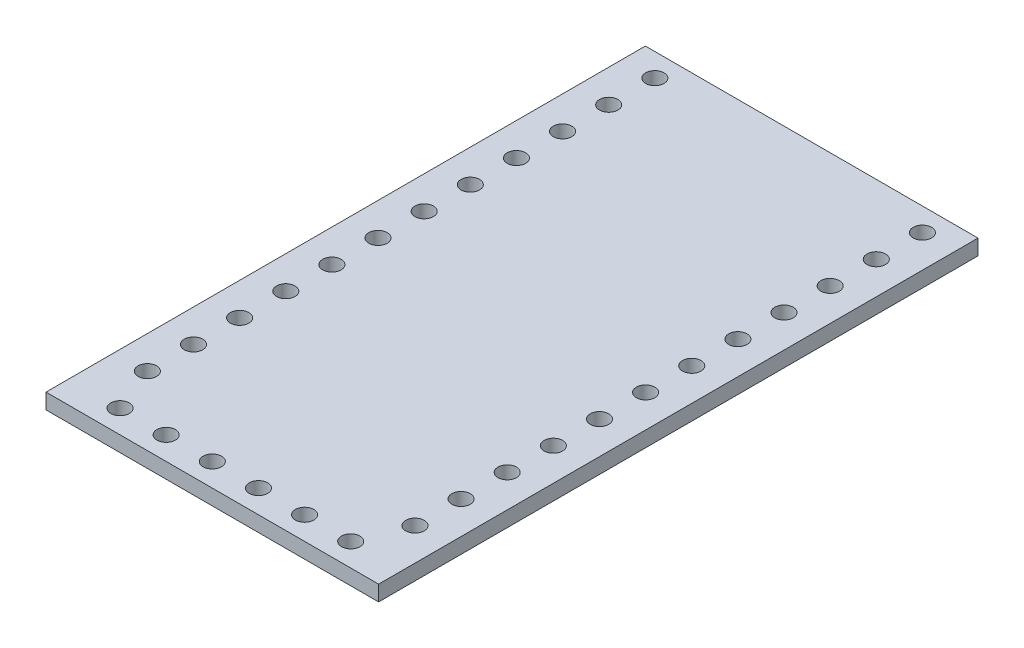
ISO-10303-21;
HEADER;
FILE_DESCRIPTION(('STEP AP214'),'2;1');
FILE_NAME('part.step','',(''),(''),'','','');
FILE_SCHEMA(('AUTOMOTIVE_DESIGN { 1 0 10303 214 1 1 1 1 }'));
ENDSEC;
DATA;
#1=APPLICATION_CONTEXT('core data for automotive mechanical design processes');
#2=APPLICATION_PROTOCOL_DEFINITION('international standard','automotive_design',2000,#1);
#3=PRODUCT_CONTEXT('',#1,'mechanical');
#4=PRODUCT('Part','Part','',(#3));
#5=PRODUCT_RELATED_PRODUCT_CATEGORY('part','',(#4));
#6=PRODUCT_DEFINITION_FORMATION('','',#4);
#7=PRODUCT_DEFINITION_CONTEXT('part definition',#1,'design');
#8=PRODUCT_DEFINITION('design','',#6,#7);
#9=PRODUCT_DEFINITION_SHAPE('','',#8);
#10=(LENGTH_UNIT() NAMED_UNIT(*) SI_UNIT(.MILLI.,.METRE.));
#11=(NAMED_UNIT(*) PLANE_ANGLE_UNIT() SI_UNIT($,.RADIAN.));
#12=(NAMED_UNIT(*) SI_UNIT($,.STERADIAN.) SOLID_ANGLE_UNIT());
#13=UNCERTAINTY_MEASURE_WITH_UNIT(LENGTH_MEASURE(1.E-05),#10,'distance_accuracy_value','');
#14=(GEOMETRIC_REPRESENTATION_CONTEXT(3) GLOBAL_UNCERTAINTY_ASSIGNED_CONTEXT((#13)) GLOBAL_UNIT_ASSIGNED_CONTEXT((#10,
#11,#12)) REPRESENTATION_CONTEXT('',''));
#15=CARTESIAN_POINT('',(0.,0.,0.));
#16=DIRECTION('',(0.,0.,1.));
#17=DIRECTION('',(1.,0.,0.));
#18=AXIS2_PLACEMENT_3D('',#15,#16,#17);
#19=CARTESIAN_POINT('',(9.1567,0.425,16.5));
#20=DIRECTION('',(0.,-1.,0.));
#21=DIRECTION('',(0.,0.,-1.));
#22=AXIS2_PLACEMENT_3D('',#19,#20,#21);
#23=PLANE('',#22);
#24=CARTESIAN_POINT('',(7.366,0.425,-12.69));
#25=DIRECTION('',(0.,1.,0.));
#26=DIRECTION('',(0.,0.,-1.));
#27=AXIS2_PLACEMENT_3D('',#24,#25,#26);
#28=CIRCLE('',#27,0.508000000000001);
#29=CARTESIAN_POINT('',(7.366,0.425,-13.198));
#30=VERTEX_POINT('',#29);
#31=EDGE_CURVE('E279',#30,#30,#28,.T.);
#32=ORIENTED_EDGE('',*,*,#31,.F.);
#33=EDGE_LOOP('',(#32));
#34=FACE_BOUND('',#33,.T.);
#35=CARTESIAN_POINT('',(7.366,0.425,-7.61));
#36=DIRECTION('',(0.,1.,0.));
#37=DIRECTION('',(0.,0.,-1.));
#38=AXIS2_PLACEMENT_3D('',#35,#36,#37);
#39=CIRCLE('',#38,0.508000000000002);
#40=CARTESIAN_POINT('',(7.366,0.425,-8.118));
#41=VERTEX_POINT('',#40);
#42=EDGE_CURVE('E267',#41,#41,#39,.T.);
#43=ORIENTED_EDGE('',*,*,#42,.F.);
#44=EDGE_LOOP('',(#43));
#45=FACE_BOUND('',#44,.T.);
#46=CARTESIAN_POINT('',(7.366,0.425,-2.53));
#47=DIRECTION('',(0.,1.,0.));
#48=DIRECTION('',(0.,0.,-1.));
#49=AXIS2_PLACEMENT_3D('',#46,#47,#48);
#50=CIRCLE('',#49,0.508000000000001);
#51=CARTESIAN_POINT('',(7.366,0.425,-3.038));
#52=VERTEX_POINT('',#51);
#53=EDGE_CURVE('E255',#52,#52,#50,.T.);
#54=ORIENTED_EDGE('',*,*,#53,.F.);
#55=EDGE_LOOP('',(#54));
#56=FACE_BOUND('',#55,.T.);
#57=CARTESIAN_POINT('',(7.366,0.425,2.55));
#58=DIRECTION('',(0.,1.,0.));
#59=DIRECTION('',(0.,0.,-1.));
#60=AXIS2_PLACEMENT_3D('',#57,#58,#59);
#61=CIRCLE('',#60,0.508000000000001);
#62=CARTESIAN_POINT('',(7.366,0.425,2.042));
#63=VERTEX_POINT('',#62);
#64=EDGE_CURVE('E243',#63,#63,#61,.T.);
#65=ORIENTED_EDGE('',*,*,#64,.F.);
#66=EDGE_LOOP('',(#65));
#67=FACE_BOUND('',#66,.T.);
#68=CARTESIAN_POINT('',(7.366,0.425,7.63));
#69=DIRECTION('',(0.,1.,0.));
#70=DIRECTION('',(0.,0.,-1.));
#71=AXIS2_PLACEMENT_3D('',#68,#69,#70);
#72=CIRCLE('',#71,0.508000000000001);
#73=CARTESIAN_POINT('',(7.366,0.425,7.122));
#74=VERTEX_POINT('',#73);
#75=EDGE_CURVE('E231',#74,#74,#72,.T.);
#76=ORIENTED_EDGE('',*,*,#75,.F.);
#77=EDGE_LOOP('',(#76));
#78=FACE_BOUND('',#77,.T.);
#79=CARTESIAN_POINT('',(7.366,0.425,12.71));
#80=DIRECTION('',(0.,1.,0.));
#81=DIRECTION('',(0.,0.,-1.));
#82=AXIS2_PLACEMENT_3D('',#79,#80,#81);
#83=CIRCLE('',#82,0.508000000000001);
#84=CARTESIAN_POINT('',(7.366,0.425,12.202));
#85=VERTEX_POINT('',#84);
#86=EDGE_CURVE('E219',#85,#85,#83,.T.);
#87=ORIENTED_EDGE('',*,*,#86,.F.);
#88=EDGE_LOOP('',(#87));
#89=FACE_BOUND('',#88,.T.);
#90=CARTESIAN_POINT('',(-7.366,0.425,10.17));
#91=DIRECTION('',(0.,1.,0.));
#92=DIRECTION('',(0.,0.,1.));
#93=AXIS2_PLACEMENT_3D('',#90,#91,#92);
#94=CIRCLE('',#93,0.508);
#95=CARTESIAN_POINT('',(-7.366,0.425,10.678));
#96=VERTEX_POINT('',#95);
#97=EDGE_CURVE('E207',#96,#96,#94,.T.);
#98=ORIENTED_EDGE('',*,*,#97,.F.);
#99=EDGE_LOOP('',(#98));
#100=FACE_BOUND('',#99,.T.);
#101=CARTESIAN_POINT('',(-7.366,0.425,5.09));
#102=DIRECTION('',(0.,1.,0.));
#103=DIRECTION('',(0.,0.,1.));
#104=AXIS2_PLACEMENT_3D('',#101,#102,#103);
#105=CIRCLE('',#104,0.508);
#106=CARTESIAN_POINT('',(-7.366,0.425,5.598));
#107=VERTEX_POINT('',#106);
#108=EDGE_CURVE('E195',#107,#107,#105,.T.);
#109=ORIENTED_EDGE('',*,*,#108,.F.);
#110=EDGE_LOOP('',(#109));
#111=FACE_BOUND('',#110,.T.);
#112=CARTESIAN_POINT('',(-7.366,0.425,0.0100000000000022));
#113=DIRECTION('',(0.,1.,0.));
#114=DIRECTION('',(0.,0.,1.));
#115=AXIS2_PLACEMENT_3D('',#112,#113,#114);
#116=CIRCLE('',#115,0.508);
#117=CARTESIAN_POINT('',(-7.366,0.425,0.518000000000002));
#118=VERTEX_POINT('',#117);
#119=EDGE_CURVE('E183',#118,#118,#116,.T.);
#120=ORIENTED_EDGE('',*,*,#119,.F.);
#121=EDGE_LOOP('',(#120));
#122=FACE_BOUND('',#121,.T.);
#123=CARTESIAN_POINT('',(-7.366,0.425,-5.07));
#124=DIRECTION('',(0.,1.,0.));
#125=DIRECTION('',(0.,0.,1.));
#126=AXIS2_PLACEMENT_3D('',#123,#124,#125);
#127=CIRCLE('',#126,0.508);
#128=CARTESIAN_POINT('',(-7.366,0.425,-4.562));
#129=VERTEX_POINT('',#128);
#130=EDGE_CURVE('E171',#129,#129,#127,.T.);
#131=ORIENTED_EDGE('',*,*,#130,.F.);
#132=EDGE_LOOP('',(#131));
#133=FACE_BOUND('',#132,.T.);
#134=CARTESIAN_POINT('',(-7.366,0.425,-10.15));
#135=DIRECTION('',(0.,1.,0.));
#136=DIRECTION('',(0.,0.,1.));
#137=AXIS2_PLACEMENT_3D('',#134,#135,#136);
#138=CIRCLE('',#137,0.508);
#139=CARTESIAN_POINT('',(-7.366,0.425,-9.642));
#140=VERTEX_POINT('',#139);
#141=EDGE_CURVE('E159',#140,#140,#138,.T.);
#142=ORIENTED_EDGE('',*,*,#141,.F.);
#143=EDGE_LOOP('',(#142));
#144=FACE_BOUND('',#143,.T.);
#145=CARTESIAN_POINT('',(-7.366,0.425,-15.23));
#146=DIRECTION('',(0.,1.,0.));
#147=DIRECTION('',(0.,0.,1.));
#148=AXIS2_PLACEMENT_3D('',#145,#146,#147);
#149=CIRCLE('',#148,0.508);
#150=CARTESIAN_POINT('',(-7.366,0.425,-14.722));
#151=VERTEX_POINT('',#150);
#152=EDGE_CURVE('E147',#151,#151,#149,.T.);
#153=ORIENTED_EDGE('',*,*,#152,.F.);
#154=EDGE_LOOP('',(#153));
#155=FACE_BOUND('',#154,.T.);
#156=CARTESIAN_POINT('',(3.81,0.425,15.23));
#157=DIRECTION('',(0.,1.,0.));
#158=DIRECTION('',(0.,0.,1.));
#159=AXIS2_PLACEMENT_3D('',#156,#157,#158);
#160=CIRCLE('',#159,0.508000000000001);
#161=CARTESIAN_POINT('',(3.81,0.425,15.738));
#162=VERTEX_POINT('',#161);
#163=EDGE_CURVE('E135',#162,#162,#160,.T.);
#164=ORIENTED_EDGE('',*,*,#163,.F.);
#165=EDGE_LOOP('',(#164));
#166=FACE_BOUND('',#165,.T.);
#167=CARTESIAN_POINT('',(-1.27,0.425,15.23));
#168=DIRECTION('',(0.,1.,0.));
#169=DIRECTION('',(0.,0.,1.));
#170=AXIS2_PLACEMENT_3D('',#167,#168,#169);
#171=CIRCLE('',#170,0.507999999999999);
#172=CARTESIAN_POINT('',(-1.27,0.425,15.738));
#173=VERTEX_POINT('',#172);
#174=EDGE_CURVE('E123',#173,#173,#171,.T.);
#175=ORIENTED_EDGE('',*,*,#174,.F.);
#176=EDGE_LOOP('',(#175));
#177=FACE_BOUND('',#176,.T.);
#178=CARTESIAN_POINT('',(-6.35,0.425,15.23));
#179=DIRECTION('',(0.,1.,0.));
#180=DIRECTION('',(0.,0.,1.));
#181=AXIS2_PLACEMENT_3D('',#178,#179,#180);
#182=CIRCLE('',#181,0.508);
#183=CARTESIAN_POINT('',(-6.35,0.425,15.738));
#184=VERTEX_POINT('',#183);
#185=EDGE_CURVE('E102',#184,#184,#182,.T.);
#186=ORIENTED_EDGE('',*,*,#185,.F.);
#187=EDGE_LOOP('',(#186));
#188=FACE_BOUND('',#187,.T.);
#189=DIRECTION('',(1.,0.,0.));
#190=VECTOR('',#189,1.);
#191=CARTESIAN_POINT('',(-9.1567,0.425,16.5));
#192=LINE('',#191,#190);
#193=CARTESIAN_POINT('',(-9.1567,0.425,16.5));
#194=VERTEX_POINT('',#193);
#195=CARTESIAN_POINT('',(9.1567,0.425,16.5));
#196=VERTEX_POINT('',#195);
#197=EDGE_CURVE('E87',#194,#196,#192,.T.);
#198=ORIENTED_EDGE('',*,*,#197,.T.);
#199=DIRECTION('',(0.,0.,-1.));
#200=VECTOR('',#199,1.);
#201=CARTESIAN_POINT('',(9.1567,0.425,-16.5));
#202=LINE('',#201,#200);
#203=CARTESIAN_POINT('',(9.1567,0.425,-16.5));
#204=VERTEX_POINT('',#203);
#205=EDGE_CURVE('E82',#196,#204,#202,.T.);
#206=ORIENTED_EDGE('',*,*,#205,.T.);
#207=DIRECTION('',(-1.,0.,0.));
#208=VECTOR('',#207,1.);
#209=CARTESIAN_POINT('',(-9.1567,0.425,-16.5));
#210=LINE('',#209,#208);
#211=CARTESIAN_POINT('',(-9.1567,0.425,-16.5));
#212=VERTEX_POINT('',#211);
#213=EDGE_CURVE('E85',#204,#212,#210,.T.);
#214=ORIENTED_EDGE('',*,*,#213,.T.);
#215=DIRECTION('',(0.,0.,1.));
#216=VECTOR('',#215,1.);
#217=CARTESIAN_POINT('',(-9.1567,0.425,-16.5));
#218=LINE('',#217,#216);
#219=EDGE_CURVE('E52',#212,#194,#218,.T.);
#220=ORIENTED_EDGE('',*,*,#219,.T.);
#221=EDGE_LOOP('',(#198,#206,#214,#220));
#222=FACE_BOUND('',#221,.T.);
#223=CARTESIAN_POINT('',(-3.81,0.425,15.23));
#224=DIRECTION('',(0.,1.,0.));
#225=DIRECTION('',(0.,0.,1.));
#226=AXIS2_PLACEMENT_3D('',#223,#224,#225);
#227=CIRCLE('',#226,0.508);
#228=CARTESIAN_POINT('',(-3.81,0.425,15.738));
#229=VERTEX_POINT('',#228);
#230=EDGE_CURVE('E117',#229,#229,#227,.T.);
#231=ORIENTED_EDGE('',*,*,#230,.F.);
#232=EDGE_LOOP('',(#231));
#233=FACE_BOUND('',#232,.T.);
#234=CARTESIAN_POINT('',(1.27,0.425,15.23));
#235=DIRECTION('',(0.,1.,0.));
#236=DIRECTION('',(0.,0.,1.));
#237=AXIS2_PLACEMENT_3D('',#234,#235,#236);
#238=CIRCLE('',#237,0.508);
#239=CARTESIAN_POINT('',(1.27,0.425,15.738));
#240=VERTEX_POINT('',#239);
#241=EDGE_CURVE('E129',#240,#240,#238,.T.);
#242=ORIENTED_EDGE('',*,*,#241,.F.);
#243=EDGE_LOOP('',(#242));
#244=FACE_BOUND('',#243,.T.);
#245=CARTESIAN_POINT('',(6.35,0.425,15.23));
#246=DIRECTION('',(0.,1.,0.));
#247=DIRECTION('',(0.,0.,1.));
#248=AXIS2_PLACEMENT_3D('',#245,#246,#247);
#249=CIRCLE('',#248,0.508);
#250=CARTESIAN_POINT('',(6.35,0.425,15.738));
#251=VERTEX_POINT('',#250);
#252=EDGE_CURVE('E141',#251,#251,#249,.T.);
#253=ORIENTED_EDGE('',*,*,#252,.F.);
#254=EDGE_LOOP('',(#253));
#255=FACE_BOUND('',#254,.T.);
#256=CARTESIAN_POINT('',(-7.366,0.425,-12.69));
#257=DIRECTION('',(0.,1.,0.));
#258=DIRECTION('',(0.,0.,1.));
#259=AXIS2_PLACEMENT_3D('',#256,#257,#258);
#260=CIRCLE('',#259,0.508);
#261=CARTESIAN_POINT('',(-7.366,0.425,-12.182));
#262=VERTEX_POINT('',#261);
#263=EDGE_CURVE('E153',#262,#262,#260,.T.);
#264=ORIENTED_EDGE('',*,*,#263,.F.);
#265=EDGE_LOOP('',(#264));
#266=FACE_BOUND('',#265,.T.);
#267=CARTESIAN_POINT('',(-7.366,0.425,-7.61));
#268=DIRECTION('',(0.,1.,0.));
#269=DIRECTION('',(0.,0.,1.));
#270=AXIS2_PLACEMENT_3D('',#267,#268,#269);
#271=CIRCLE('',#270,0.508000000000001);
#272=CARTESIAN_POINT('',(-7.366,0.425,-7.102));
#273=VERTEX_POINT('',#272);
#274=EDGE_CURVE('E165',#273,#273,#271,.T.);
#275=ORIENTED_EDGE('',*,*,#274,.F.);
#276=EDGE_LOOP('',(#275));
#277=FACE_BOUND('',#276,.T.);
#278=CARTESIAN_POINT('',(-7.366,0.425,-2.53));
#279=DIRECTION('',(0.,1.,0.));
#280=DIRECTION('',(0.,0.,1.));
#281=AXIS2_PLACEMENT_3D('',#278,#279,#280);
#282=CIRCLE('',#281,0.508);
#283=CARTESIAN_POINT('',(-7.366,0.425,-2.022));
#284=VERTEX_POINT('',#283);
#285=EDGE_CURVE('E177',#284,#284,#282,.T.);
#286=ORIENTED_EDGE('',*,*,#285,.F.);
#287=EDGE_LOOP('',(#286));
#288=FACE_BOUND('',#287,.T.);
#289=CARTESIAN_POINT('',(-7.366,0.425,2.55));
#290=DIRECTION('',(0.,1.,0.));
#291=DIRECTION('',(0.,0.,1.));
#292=AXIS2_PLACEMENT_3D('',#289,#290,#291);
#293=CIRCLE('',#292,0.508);
#294=CARTESIAN_POINT('',(-7.366,0.425,3.058));
#295=VERTEX_POINT('',#294);
#296=EDGE_CURVE('E189',#295,#295,#293,.T.);
#297=ORIENTED_EDGE('',*,*,#296,.F.);
#298=EDGE_LOOP('',(#297));
#299=FACE_BOUND('',#298,.T.);
#300=CARTESIAN_POINT('',(-7.366,0.425,7.63));
#301=DIRECTION('',(0.,1.,0.));
#302=DIRECTION('',(0.,0.,1.));
#303=AXIS2_PLACEMENT_3D('',#300,#301,#302);
#304=CIRCLE('',#303,0.508000000000001);
#305=CARTESIAN_POINT('',(-7.366,0.425,8.13800000000001));
#306=VERTEX_POINT('',#305);
#307=EDGE_CURVE('E201',#306,#306,#304,.T.);
#308=ORIENTED_EDGE('',*,*,#307,.F.);
#309=EDGE_LOOP('',(#308));
#310=FACE_BOUND('',#309,.T.);
#311=CARTESIAN_POINT('',(-7.366,0.425,12.71));
#312=DIRECTION('',(0.,1.,0.));
#313=DIRECTION('',(0.,0.,1.));
#314=AXIS2_PLACEMENT_3D('',#311,#312,#313);
#315=CIRCLE('',#314,0.508);
#316=CARTESIAN_POINT('',(-7.366,0.425,13.218));
#317=VERTEX_POINT('',#316);
#318=EDGE_CURVE('E213',#317,#317,#315,.T.);
#319=ORIENTED_EDGE('',*,*,#318,.F.);
#320=EDGE_LOOP('',(#319));
#321=FACE_BOUND('',#320,.T.);
#322=CARTESIAN_POINT('',(7.366,0.425,10.17));
#323=DIRECTION('',(0.,1.,0.));
#324=DIRECTION('',(0.,0.,-1.));
#325=AXIS2_PLACEMENT_3D('',#322,#323,#324);
#326=CIRCLE('',#325,0.508000000000001);
#327=CARTESIAN_POINT('',(7.366,0.425,9.662));
#328=VERTEX_POINT('',#327);
#329=EDGE_CURVE('E225',#328,#328,#326,.T.);
#330=ORIENTED_EDGE('',*,*,#329,.F.);
#331=EDGE_LOOP('',(#330));
#332=FACE_BOUND('',#331,.T.);
#333=CARTESIAN_POINT('',(7.366,0.425,5.09));
#334=DIRECTION('',(0.,1.,0.));
#335=DIRECTION('',(0.,0.,-1.));
#336=AXIS2_PLACEMENT_3D('',#333,#334,#335);
#337=CIRCLE('',#336,0.508);
#338=CARTESIAN_POINT('',(7.366,0.425,4.582));
#339=VERTEX_POINT('',#338);
#340=EDGE_CURVE('E237',#339,#339,#337,.T.);
#341=ORIENTED_EDGE('',*,*,#340,.F.);
#342=EDGE_LOOP('',(#341));
#343=FACE_BOUND('',#342,.T.);
#344=CARTESIAN_POINT('',(7.366,0.425,0.0100000000000022));
#345=DIRECTION('',(0.,1.,0.));
#346=DIRECTION('',(0.,0.,-1.));
#347=AXIS2_PLACEMENT_3D('',#344,#345,#346);
#348=CIRCLE('',#347,0.508);
#349=CARTESIAN_POINT('',(7.366,0.425,-0.497999999999998));
#350=VERTEX_POINT('',#349);
#351=EDGE_CURVE('E249',#350,#350,#348,.T.);
#352=ORIENTED_EDGE('',*,*,#351,.F.);
#353=EDGE_LOOP('',(#352));
#354=FACE_BOUND('',#353,.T.);
#355=CARTESIAN_POINT('',(7.366,0.425,-5.07));
#356=DIRECTION('',(0.,1.,0.));
#357=DIRECTION('',(0.,0.,-1.));
#358=AXIS2_PLACEMENT_3D('',#355,#356,#357);
#359=CIRCLE('',#358,0.508);
#360=CARTESIAN_POINT('',(7.366,0.425,-5.578));
#361=VERTEX_POINT('',#360);
#362=EDGE_CURVE('E261',#361,#361,#359,.T.);
#363=ORIENTED_EDGE('',*,*,#362,.F.);
#364=EDGE_LOOP('',(#363));
#365=FACE_BOUND('',#364,.T.);
#366=CARTESIAN_POINT('',(7.366,0.425,-10.15));
#367=DIRECTION('',(0.,1.,0.));
#368=DIRECTION('',(0.,0.,-1.));
#369=AXIS2_PLACEMENT_3D('',#366,#367,#368);
#370=CIRCLE('',#369,0.508);
#371=CARTESIAN_POINT('',(7.366,0.425,-10.658));
#372=VERTEX_POINT('',#371);
#373=EDGE_CURVE('E273',#372,#372,#370,.T.);
#374=ORIENTED_EDGE('',*,*,#373,.F.);
#375=EDGE_LOOP('',(#374));
#376=FACE_BOUND('',#375,.T.);
#377=CARTESIAN_POINT('',(7.366,0.425,-15.23));
#378=DIRECTION('',(0.,1.,0.));
#379=DIRECTION('',(0.,0.,-1.));
#380=AXIS2_PLACEMENT_3D('',#377,#378,#379);
#381=CIRCLE('',#380,0.508);
#382=CARTESIAN_POINT('',(7.366,0.425,-15.738));
#383=VERTEX_POINT('',#382);
#384=EDGE_CURVE('E285',#383,#383,#381,.T.);
#385=ORIENTED_EDGE('',*,*,#384,.F.);
#386=EDGE_LOOP('',(#385));
#387=FACE_BOUND('',#386,.T.);
#388=ADVANCED_FACE('F35',(#34,#45,#56,#67,#78,#89,#100,#111,#122,#133,#144,#155,#166,#177,#188,
#222,#233,#244,#255,#266,#277,#288,#299,#310,#321,#332,#343,#354,#365,#376,#387),#23,.F.);
#389=CARTESIAN_POINT('',(9.1567,-0.425,16.5));
#390=DIRECTION('',(0.,-1.,0.));
#391=DIRECTION('',(0.,0.,-1.));
#392=AXIS2_PLACEMENT_3D('',#389,#390,#391);
#393=PLANE('',#392);
#394=CARTESIAN_POINT('',(7.366,-0.425,-12.69));
#395=DIRECTION('',(0.,1.,0.));
#396=DIRECTION('',(0.,0.,-1.));
#397=AXIS2_PLACEMENT_3D('',#394,#395,#396);
#398=CIRCLE('',#397,0.508000000000001);
#399=CARTESIAN_POINT('',(7.366,-0.425,-13.198));
#400=VERTEX_POINT('',#399);
#401=EDGE_CURVE('E282',#400,#400,#398,.T.);
#402=ORIENTED_EDGE('',*,*,#401,.T.);
#403=EDGE_LOOP('',(#402));
#404=FACE_BOUND('',#403,.T.);
#405=CARTESIAN_POINT('',(7.366,-0.425,-7.61));
#406=DIRECTION('',(0.,1.,0.));
#407=DIRECTION('',(0.,0.,-1.));
#408=AXIS2_PLACEMENT_3D('',#405,#406,#407);
#409=CIRCLE('',#408,0.508000000000002);
#410=CARTESIAN_POINT('',(7.366,-0.425,-8.118));
#411=VERTEX_POINT('',#410);
#412=EDGE_CURVE('E270',#411,#411,#409,.T.);
#413=ORIENTED_EDGE('',*,*,#412,.T.);
#414=EDGE_LOOP('',(#413));
#415=FACE_BOUND('',#414,.T.);
#416=CARTESIAN_POINT('',(7.366,-0.425,-2.53));
#417=DIRECTION('',(0.,1.,0.));
#418=DIRECTION('',(0.,0.,-1.));
#419=AXIS2_PLACEMENT_3D('',#416,#417,#418);
#420=CIRCLE('',#419,0.508000000000001);
#421=CARTESIAN_POINT('',(7.366,-0.425,-3.038));
#422=VERTEX_POINT('',#421);
#423=EDGE_CURVE('E258',#422,#422,#420,.T.);
#424=ORIENTED_EDGE('',*,*,#423,.T.);
#425=EDGE_LOOP('',(#424));
#426=FACE_BOUND('',#425,.T.);
#427=CARTESIAN_POINT('',(7.366,-0.425,2.55));
#428=DIRECTION('',(0.,1.,0.));
#429=DIRECTION('',(0.,0.,-1.));
#430=AXIS2_PLACEMENT_3D('',#427,#428,#429);
#431=CIRCLE('',#430,0.508000000000001);
#432=CARTESIAN_POINT('',(7.366,-0.425,2.042));
#433=VERTEX_POINT('',#432);
#434=EDGE_CURVE('E246',#433,#433,#431,.T.);
#435=ORIENTED_EDGE('',*,*,#434,.T.);
#436=EDGE_LOOP('',(#435));
#437=FACE_BOUND('',#436,.T.);
#438=CARTESIAN_POINT('',(7.366,-0.425,7.63));
#439=DIRECTION('',(0.,1.,0.));
#440=DIRECTION('',(0.,0.,-1.));
#441=AXIS2_PLACEMENT_3D('',#438,#439,#440);
#442=CIRCLE('',#441,0.508000000000001);
#443=CARTESIAN_POINT('',(7.366,-0.425,7.122));
#444=VERTEX_POINT('',#443);
#445=EDGE_CURVE('E234',#444,#444,#442,.T.);
#446=ORIENTED_EDGE('',*,*,#445,.T.);
#447=EDGE_LOOP('',(#446));
#448=FACE_BOUND('',#447,.T.);
#449=CARTESIAN_POINT('',(7.366,-0.425,12.71));
#450=DIRECTION('',(0.,1.,0.));
#451=DIRECTION('',(0.,0.,-1.));
#452=AXIS2_PLACEMENT_3D('',#449,#450,#451);
#453=CIRCLE('',#452,0.508000000000001);
#454=CARTESIAN_POINT('',(7.366,-0.425,12.202));
#455=VERTEX_POINT('',#454);
#456=EDGE_CURVE('E222',#455,#455,#453,.T.);
#457=ORIENTED_EDGE('',*,*,#456,.T.);
#458=EDGE_LOOP('',(#457));
#459=FACE_BOUND('',#458,.T.);
#460=CARTESIAN_POINT('',(-7.366,-0.425,10.17));
#461=DIRECTION('',(0.,1.,0.));
#462=DIRECTION('',(0.,0.,1.));
#463=AXIS2_PLACEMENT_3D('',#460,#461,#462);
#464=CIRCLE('',#463,0.508);
#465=CARTESIAN_POINT('',(-7.366,-0.425,10.678));
#466=VERTEX_POINT('',#465);
#467=EDGE_CURVE('E210',#466,#466,#464,.T.);
#468=ORIENTED_EDGE('',*,*,#467,.T.);
#469=EDGE_LOOP('',(#468));
#470=FACE_BOUND('',#469,.T.);
#471=CARTESIAN_POINT('',(-7.366,-0.425,5.09));
#472=DIRECTION('',(0.,1.,0.));
#473=DIRECTION('',(0.,0.,1.));
#474=AXIS2_PLACEMENT_3D('',#471,#472,#473);
#475=CIRCLE('',#474,0.508);
#476=CARTESIAN_POINT('',(-7.366,-0.425,5.598));
#477=VERTEX_POINT('',#476);
#478=EDGE_CURVE('E198',#477,#477,#475,.T.);
#479=ORIENTED_EDGE('',*,*,#478,.T.);
#480=EDGE_LOOP('',(#479));
#481=FACE_BOUND('',#480,.T.);
#482=CARTESIAN_POINT('',(-7.366,-0.425,0.0100000000000022));
#483=DIRECTION('',(0.,1.,0.));
#484=DIRECTION('',(0.,0.,1.));
#485=AXIS2_PLACEMENT_3D('',#482,#483,#484);
#486=CIRCLE('',#485,0.508);
#487=CARTESIAN_POINT('',(-7.366,-0.425,0.518000000000002));
#488=VERTEX_POINT('',#487);
#489=EDGE_CURVE('E186',#488,#488,#486,.T.);
#490=ORIENTED_EDGE('',*,*,#489,.T.);
#491=EDGE_LOOP('',(#490));
#492=FACE_BOUND('',#491,.T.);
#493=CARTESIAN_POINT('',(-7.366,-0.425,-5.07));
#494=DIRECTION('',(0.,1.,0.));
#495=DIRECTION('',(0.,0.,1.));
#496=AXIS2_PLACEMENT_3D('',#493,#494,#495);
#497=CIRCLE('',#496,0.508);
#498=CARTESIAN_POINT('',(-7.366,-0.425,-4.562));
#499=VERTEX_POINT('',#498);
#500=EDGE_CURVE('E174',#499,#499,#497,.T.);
#501=ORIENTED_EDGE('',*,*,#500,.T.);
#502=EDGE_LOOP('',(#501));
#503=FACE_BOUND('',#502,.T.);
#504=CARTESIAN_POINT('',(-7.366,-0.425,-10.15));
#505=DIRECTION('',(0.,1.,0.));
#506=DIRECTION('',(0.,0.,1.));
#507=AXIS2_PLACEMENT_3D('',#504,#505,#506);
#508=CIRCLE('',#507,0.508);
#509=CARTESIAN_POINT('',(-7.366,-0.425,-9.642));
#510=VERTEX_POINT('',#509);
#511=EDGE_CURVE('E162',#510,#510,#508,.T.);
#512=ORIENTED_EDGE('',*,*,#511,.T.);
#513=EDGE_LOOP('',(#512));
#514=FACE_BOUND('',#513,.T.);
#515=CARTESIAN_POINT('',(-7.366,-0.425,-15.23));
#516=DIRECTION('',(0.,1.,0.));
#517=DIRECTION('',(0.,0.,1.));
#518=AXIS2_PLACEMENT_3D('',#515,#516,#517);
#519=CIRCLE('',#518,0.508);
#520=CARTESIAN_POINT('',(-7.366,-0.425,-14.722));
#521=VERTEX_POINT('',#520);
#522=EDGE_CURVE('E150',#521,#521,#519,.T.);
#523=ORIENTED_EDGE('',*,*,#522,.T.);
#524=EDGE_LOOP('',(#523));
#525=FACE_BOUND('',#524,.T.);
#526=CARTESIAN_POINT('',(3.81,-0.425,15.23));
#527=DIRECTION('',(0.,1.,0.));
#528=DIRECTION('',(0.,0.,1.));
#529=AXIS2_PLACEMENT_3D('',#526,#527,#528);
#530=CIRCLE('',#529,0.508000000000001);
#531=CARTESIAN_POINT('',(3.81,-0.425,15.738));
#532=VERTEX_POINT('',#531);
#533=EDGE_CURVE('E138',#532,#532,#530,.T.);
#534=ORIENTED_EDGE('',*,*,#533,.T.);
#535=EDGE_LOOP('',(#534));
#536=FACE_BOUND('',#535,.T.);
#537=CARTESIAN_POINT('',(-1.27,-0.425,15.23));
#538=DIRECTION('',(0.,1.,0.));
#539=DIRECTION('',(0.,0.,1.));
#540=AXIS2_PLACEMENT_3D('',#537,#538,#539);
#541=CIRCLE('',#540,0.507999999999999);
#542=CARTESIAN_POINT('',(-1.27,-0.425,15.738));
#543=VERTEX_POINT('',#542);
#544=EDGE_CURVE('E126',#543,#543,#541,.T.);
#545=ORIENTED_EDGE('',*,*,#544,.T.);
#546=EDGE_LOOP('',(#545));
#547=FACE_BOUND('',#546,.T.);
#548=CARTESIAN_POINT('',(-6.35,-0.425,15.23));
#549=DIRECTION('',(0.,1.,0.));
#550=DIRECTION('',(0.,0.,1.));
#551=AXIS2_PLACEMENT_3D('',#548,#549,#550);
#552=CIRCLE('',#551,0.508);
#553=CARTESIAN_POINT('',(-6.35,-0.425,15.738));
#554=VERTEX_POINT('',#553);
#555=EDGE_CURVE('E114',#554,#554,#552,.T.);
#556=ORIENTED_EDGE('',*,*,#555,.T.);
#557=EDGE_LOOP('',(#556));
#558=FACE_BOUND('',#557,.T.);
#559=DIRECTION('',(1.,0.,0.));
#560=VECTOR('',#559,1.);
#561=CARTESIAN_POINT('',(-9.1567,-0.425,16.5));
#562=LINE('',#561,#560);
#563=CARTESIAN_POINT('',(-9.1567,-0.425,16.5));
#564=VERTEX_POINT('',#563);
#565=CARTESIAN_POINT('',(9.1567,-0.425,16.5));
#566=VERTEX_POINT('',#565);
#567=EDGE_CURVE('E99',#564,#566,#562,.T.);
#568=ORIENTED_EDGE('',*,*,#567,.F.);
#569=DIRECTION('',(0.,0.,1.));
#570=VECTOR('',#569,1.);
#571=CARTESIAN_POINT('',(-9.1567,-0.425,-16.5));
#572=LINE('',#571,#570);
#573=CARTESIAN_POINT('',(-9.1567,-0.425,-16.5));
#574=VERTEX_POINT('',#573);
#575=EDGE_CURVE('E75',#574,#564,#572,.T.);
#576=ORIENTED_EDGE('',*,*,#575,.F.);
#577=DIRECTION('',(-1.,0.,0.));
#578=VECTOR('',#577,1.);
#579=CARTESIAN_POINT('',(-9.1567,-0.425,-16.5));
#580=LINE('',#579,#578);
#581=CARTESIAN_POINT('',(9.1567,-0.425,-16.5));
#582=VERTEX_POINT('',#581);
#583=EDGE_CURVE('E69',#582,#574,#580,.T.);
#584=ORIENTED_EDGE('',*,*,#583,.F.);
#585=DIRECTION('',(0.,0.,-1.));
#586=VECTOR('',#585,1.);
#587=CARTESIAN_POINT('',(9.1567,-0.425,-16.5));
#588=LINE('',#587,#586);
#589=EDGE_CURVE('E91',#566,#582,#588,.T.);
#590=ORIENTED_EDGE('',*,*,#589,.F.);
#591=EDGE_LOOP('',(#568,#576,#584,#590));
#592=FACE_BOUND('',#591,.T.);
#593=CARTESIAN_POINT('',(-3.81,-0.425,15.23));
#594=DIRECTION('',(0.,1.,0.));
#595=DIRECTION('',(0.,0.,1.));
#596=AXIS2_PLACEMENT_3D('',#593,#594,#595);
#597=CIRCLE('',#596,0.508);
#598=CARTESIAN_POINT('',(-3.81,-0.425,15.738));
#599=VERTEX_POINT('',#598);
#600=EDGE_CURVE('E120',#599,#599,#597,.T.);
#601=ORIENTED_EDGE('',*,*,#600,.T.);
#602=EDGE_LOOP('',(#601));
#603=FACE_BOUND('',#602,.T.);
#604=CARTESIAN_POINT('',(1.27,-0.425,15.23));
#605=DIRECTION('',(0.,1.,0.));
#606=DIRECTION('',(0.,0.,1.));
#607=AXIS2_PLACEMENT_3D('',#604,#605,#606);
#608=CIRCLE('',#607,0.508);
#609=CARTESIAN_POINT('',(1.27,-0.425,15.738));
#610=VERTEX_POINT('',#609);
#611=EDGE_CURVE('E132',#610,#610,#608,.T.);
#612=ORIENTED_EDGE('',*,*,#611,.T.);
#613=EDGE_LOOP('',(#612));
#614=FACE_BOUND('',#613,.T.);
#615=CARTESIAN_POINT('',(6.35,-0.425,15.23));
#616=DIRECTION('',(0.,1.,0.));
#617=DIRECTION('',(0.,0.,1.));
#618=AXIS2_PLACEMENT_3D('',#615,#616,#617);
#619=CIRCLE('',#618,0.508);
#620=CARTESIAN_POINT('',(6.35,-0.425,15.738));
#621=VERTEX_POINT('',#620);
#622=EDGE_CURVE('E144',#621,#621,#619,.T.);
#623=ORIENTED_EDGE('',*,*,#622,.T.);
#624=EDGE_LOOP('',(#623));
#625=FACE_BOUND('',#624,.T.);
#626=CARTESIAN_POINT('',(-7.366,-0.425,-12.69));
#627=DIRECTION('',(0.,1.,0.));
#628=DIRECTION('',(0.,0.,1.));
#629=AXIS2_PLACEMENT_3D('',#626,#627,#628);
#630=CIRCLE('',#629,0.508);
#631=CARTESIAN_POINT('',(-7.366,-0.425,-12.182));
#632=VERTEX_POINT('',#631);
#633=EDGE_CURVE('E156',#632,#632,#630,.T.);
#634=ORIENTED_EDGE('',*,*,#633,.T.);
#635=EDGE_LOOP('',(#634));
#636=FACE_BOUND('',#635,.T.);
#637=CARTESIAN_POINT('',(-7.366,-0.425,-7.61));
#638=DIRECTION('',(0.,1.,0.));
#639=DIRECTION('',(0.,0.,1.));
#640=AXIS2_PLACEMENT_3D('',#637,#638,#639);
#641=CIRCLE('',#640,0.508000000000001);
#642=CARTESIAN_POINT('',(-7.366,-0.425,-7.102));
#643=VERTEX_POINT('',#642);
#644=EDGE_CURVE('E168',#643,#643,#641,.T.);
#645=ORIENTED_EDGE('',*,*,#644,.T.);
#646=EDGE_LOOP('',(#645));
#647=FACE_BOUND('',#646,.T.);
#648=CARTESIAN_POINT('',(-7.366,-0.425,-2.53));
#649=DIRECTION('',(0.,1.,0.));
#650=DIRECTION('',(0.,0.,1.));
#651=AXIS2_PLACEMENT_3D('',#648,#649,#650);
#652=CIRCLE('',#651,0.508);
#653=CARTESIAN_POINT('',(-7.366,-0.425,-2.022));
#654=VERTEX_POINT('',#653);
#655=EDGE_CURVE('E180',#654,#654,#652,.T.);
#656=ORIENTED_EDGE('',*,*,#655,.T.);
#657=EDGE_LOOP('',(#656));
#658=FACE_BOUND('',#657,.T.);
#659=CARTESIAN_POINT('',(-7.366,-0.425,2.55));
#660=DIRECTION('',(0.,1.,0.));
#661=DIRECTION('',(0.,0.,1.));
#662=AXIS2_PLACEMENT_3D('',#659,#660,#661);
#663=CIRCLE('',#662,0.508);
#664=CARTESIAN_POINT('',(-7.366,-0.425,3.058));
#665=VERTEX_POINT('',#664);
#666=EDGE_CURVE('E192',#665,#665,#663,.T.);
#667=ORIENTED_EDGE('',*,*,#666,.T.);
#668=EDGE_LOOP('',(#667));
#669=FACE_BOUND('',#668,.T.);
#670=CARTESIAN_POINT('',(-7.366,-0.425,7.63));
#671=DIRECTION('',(0.,1.,0.));
#672=DIRECTION('',(0.,0.,1.));
#673=AXIS2_PLACEMENT_3D('',#670,#671,#672);
#674=CIRCLE('',#673,0.508000000000001);
#675=CARTESIAN_POINT('',(-7.366,-0.425,8.13800000000001));
#676=VERTEX_POINT('',#675);
#677=EDGE_CURVE('E204',#676,#676,#674,.T.);
#678=ORIENTED_EDGE('',*,*,#677,.T.);
#679=EDGE_LOOP('',(#678));
#680=FACE_BOUND('',#679,.T.);
#681=CARTESIAN_POINT('',(-7.366,-0.425,12.71));
#682=DIRECTION('',(0.,1.,0.));
#683=DIRECTION('',(0.,0.,1.));
#684=AXIS2_PLACEMENT_3D('',#681,#682,#683);
#685=CIRCLE('',#684,0.508);
#686=CARTESIAN_POINT('',(-7.366,-0.425,13.218));
#687=VERTEX_POINT('',#686);
#688=EDGE_CURVE('E216',#687,#687,#685,.T.);
#689=ORIENTED_EDGE('',*,*,#688,.T.);
#690=EDGE_LOOP('',(#689));
#691=FACE_BOUND('',#690,.T.);
#692=CARTESIAN_POINT('',(7.366,-0.425,10.17));
#693=DIRECTION('',(0.,1.,0.));
#694=DIRECTION('',(0.,0.,-1.));
#695=AXIS2_PLACEMENT_3D('',#692,#693,#694);
#696=CIRCLE('',#695,0.508000000000001);
#697=CARTESIAN_POINT('',(7.366,-0.425,9.662));
#698=VERTEX_POINT('',#697);
#699=EDGE_CURVE('E228',#698,#698,#696,.T.);
#700=ORIENTED_EDGE('',*,*,#699,.T.);
#701=EDGE_LOOP('',(#700));
#702=FACE_BOUND('',#701,.T.);
#703=CARTESIAN_POINT('',(7.366,-0.425,5.09));
#704=DIRECTION('',(0.,1.,0.));
#705=DIRECTION('',(0.,0.,-1.));
#706=AXIS2_PLACEMENT_3D('',#703,#704,#705);
#707=CIRCLE('',#706,0.508);
#708=CARTESIAN_POINT('',(7.366,-0.425,4.582));
#709=VERTEX_POINT('',#708);
#710=EDGE_CURVE('E240',#709,#709,#707,.T.);
#711=ORIENTED_EDGE('',*,*,#710,.T.);
#712=EDGE_LOOP('',(#711));
#713=FACE_BOUND('',#712,.T.);
#714=CARTESIAN_POINT('',(7.366,-0.425,0.0100000000000022));
#715=DIRECTION('',(0.,1.,0.));
#716=DIRECTION('',(0.,0.,-1.));
#717=AXIS2_PLACEMENT_3D('',#714,#715,#716);
#718=CIRCLE('',#717,0.508);
#719=CARTESIAN_POINT('',(7.366,-0.425,-0.497999999999998));
#720=VERTEX_POINT('',#719);
#721=EDGE_CURVE('E252',#720,#720,#718,.T.);
#722=ORIENTED_EDGE('',*,*,#721,.T.);
#723=EDGE_LOOP('',(#722));
#724=FACE_BOUND('',#723,.T.);
#725=CARTESIAN_POINT('',(7.366,-0.425,-5.07));
#726=DIRECTION('',(0.,1.,0.));
#727=DIRECTION('',(0.,0.,-1.));
#728=AXIS2_PLACEMENT_3D('',#725,#726,#727);
#729=CIRCLE('',#728,0.508);
#730=CARTESIAN_POINT('',(7.366,-0.425,-5.578));
#731=VERTEX_POINT('',#730);
#732=EDGE_CURVE('E264',#731,#731,#729,.T.);
#733=ORIENTED_EDGE('',*,*,#732,.T.);
#734=EDGE_LOOP('',(#733));
#735=FACE_BOUND('',#734,.T.);
#736=CARTESIAN_POINT('',(7.366,-0.425,-10.15));
#737=DIRECTION('',(0.,1.,0.));
#738=DIRECTION('',(0.,0.,-1.));
#739=AXIS2_PLACEMENT_3D('',#736,#737,#738);
#740=CIRCLE('',#739,0.508);
#741=CARTESIAN_POINT('',(7.366,-0.425,-10.658));
#742=VERTEX_POINT('',#741);
#743=EDGE_CURVE('E276',#742,#742,#740,.T.);
#744=ORIENTED_EDGE('',*,*,#743,.T.);
#745=EDGE_LOOP('',(#744));
#746=FACE_BOUND('',#745,.T.);
#747=CARTESIAN_POINT('',(7.366,-0.425,-15.23));
#748=DIRECTION('',(0.,1.,0.));
#749=DIRECTION('',(0.,0.,-1.));
#750=AXIS2_PLACEMENT_3D('',#747,#748,#749);
#751=CIRCLE('',#750,0.508);
#752=CARTESIAN_POINT('',(7.366,-0.425,-15.738));
#753=VERTEX_POINT('',#752);
#754=EDGE_CURVE('E288',#753,#753,#751,.T.);
#755=ORIENTED_EDGE('',*,*,#754,.T.);
#756=EDGE_LOOP('',(#755));
#757=FACE_BOUND('',#756,.T.);
#758=ADVANCED_FACE('F110',(#404,#415,#426,#437,#448,#459,#470,#481,#492,#503,#514,#525,#536,
#547,#558,#592,#603,#614,#625,#636,#647,#658,#669,#680,#691,#702,#713,#724,#735,#746,#757),#393,.T.);
#759=CARTESIAN_POINT('',(-9.1567,0.425,16.5));
#760=DIRECTION('',(0.,0.,-1.));
#761=DIRECTION('',(-1.,0.,0.));
#762=AXIS2_PLACEMENT_3D('',#759,#760,#761);
#763=PLANE('',#762);
#764=ORIENTED_EDGE('',*,*,#567,.T.);
#765=DIRECTION('',(0.,-1.,0.));
#766=VECTOR('',#765,1.);
#767=CARTESIAN_POINT('',(9.1567,0.425,16.5));
#768=LINE('',#767,#766);
#769=EDGE_CURVE('E11',#196,#566,#768,.T.);
#770=ORIENTED_EDGE('',*,*,#769,.F.);
#771=ORIENTED_EDGE('',*,*,#197,.F.);
#772=DIRECTION('',(0.,-1.,0.));
#773=VECTOR('',#772,1.);
#774=CARTESIAN_POINT('',(-9.1567,0.425,16.5));
#775=LINE('',#774,#773);
#776=EDGE_CURVE('E95',#194,#564,#775,.T.);
#777=ORIENTED_EDGE('',*,*,#776,.T.);
#778=EDGE_LOOP('',(#764,#770,#771,#777));
#779=FACE_BOUND('',#778,.T.);
#780=ADVANCED_FACE('F37',(#779),#763,.F.);
#781=CARTESIAN_POINT('',(9.1567,0.425,-16.5));
#782=DIRECTION('',(-1.,0.,0.));
#783=DIRECTION('',(0.,0.,1.));
#784=AXIS2_PLACEMENT_3D('',#781,#782,#783);
#785=PLANE('',#784);
#786=ORIENTED_EDGE('',*,*,#589,.T.);
#787=DIRECTION('',(0.,-1.,0.));
#788=VECTOR('',#787,1.);
#789=CARTESIAN_POINT('',(9.1567,0.425,-16.5));
#790=LINE('',#789,#788);
#791=EDGE_CURVE('E44',#204,#582,#790,.T.);
#792=ORIENTED_EDGE('',*,*,#791,.F.);
#793=ORIENTED_EDGE('',*,*,#205,.F.);
#794=ORIENTED_EDGE('',*,*,#769,.T.);
#795=EDGE_LOOP('',(#786,#792,#793,#794));
#796=FACE_BOUND('',#795,.T.);
#797=ADVANCED_FACE('F90',(#796),#785,.F.);
#798=CARTESIAN_POINT('',(-9.1567,0.425,-16.5));
#799=DIRECTION('',(0.,0.,1.));
#800=DIRECTION('',(1.,0.,0.));
#801=AXIS2_PLACEMENT_3D('',#798,#799,#800);
#802=PLANE('',#801);
#803=ORIENTED_EDGE('',*,*,#583,.T.);
#804=DIRECTION('',(0.,-1.,0.));
#805=VECTOR('',#804,1.);
#806=CARTESIAN_POINT('',(-9.1567,0.425,-16.5));
#807=LINE('',#806,#805);
#808=EDGE_CURVE('E92',#212,#574,#807,.T.);
#809=ORIENTED_EDGE('',*,*,#808,.F.);
#810=ORIENTED_EDGE('',*,*,#213,.F.);
#811=ORIENTED_EDGE('',*,*,#791,.T.);
#812=EDGE_LOOP('',(#803,#809,#810,#811));
#813=FACE_BOUND('',#812,.T.);
#814=ADVANCED_FACE('F93',(#813),#802,.F.);
#815=CARTESIAN_POINT('',(-9.1567,0.425,-16.5));
#816=DIRECTION('',(1.,0.,0.));
#817=DIRECTION('',(0.,0.,-1.));
#818=AXIS2_PLACEMENT_3D('',#815,#816,#817);
#819=PLANE('',#818);
#820=ORIENTED_EDGE('',*,*,#575,.T.);
#821=ORIENTED_EDGE('',*,*,#776,.F.);
#822=ORIENTED_EDGE('',*,*,#219,.F.);
#823=ORIENTED_EDGE('',*,*,#808,.T.);
#824=EDGE_LOOP('',(#820,#821,#822,#823));
#825=FACE_BOUND('',#824,.T.);
#826=ADVANCED_FACE('F107',(#825),#819,.F.);
#827=CARTESIAN_POINT('',(-6.35,0.425,15.23));
#828=DIRECTION('',(0.,-1.,0.));
#829=DIRECTION('',(0.,0.,-1.));
#830=AXIS2_PLACEMENT_3D('',#827,#828,#829);
#831=CYLINDRICAL_SURFACE('',#830,0.508);
#832=ORIENTED_EDGE('',*,*,#185,.T.);
#833=EDGE_LOOP('',(#832));
#834=FACE_BOUND('',#833,.T.);
#835=ORIENTED_EDGE('',*,*,#555,.F.);
#836=EDGE_LOOP('',(#835));
#837=FACE_BOUND('',#836,.T.);
#838=ADVANCED_FACE('F308',(#834,#837),#831,.F.);
#839=CARTESIAN_POINT('',(-3.81,0.425,15.23));
#840=DIRECTION('',(0.,-1.,0.));
#841=DIRECTION('',(0.,0.,-1.));
#842=AXIS2_PLACEMENT_3D('',#839,#840,#841);
#843=CYLINDRICAL_SURFACE('',#842,0.508);
#844=ORIENTED_EDGE('',*,*,#230,.T.);
#845=EDGE_LOOP('',(#844));
#846=FACE_BOUND('',#845,.T.);
#847=ORIENTED_EDGE('',*,*,#600,.F.);
#848=EDGE_LOOP('',(#847));
#849=FACE_BOUND('',#848,.T.);
#850=ADVANCED_FACE('F358',(#846,#849),#843,.F.);
#851=CARTESIAN_POINT('',(-1.27,0.425,15.23));
#852=DIRECTION('',(0.,-1.,0.));
#853=DIRECTION('',(0.,0.,-1.));
#854=AXIS2_PLACEMENT_3D('',#851,#852,#853);
#855=CYLINDRICAL_SURFACE('',#854,0.507999999999999);
#856=ORIENTED_EDGE('',*,*,#174,.T.);
#857=EDGE_LOOP('',(#856));
#858=FACE_BOUND('',#857,.T.);
#859=ORIENTED_EDGE('',*,*,#544,.F.);
#860=EDGE_LOOP('',(#859));
#861=FACE_BOUND('',#860,.T.);
#862=ADVANCED_FACE('F366',(#858,#861),#855,.F.);
#863=CARTESIAN_POINT('',(1.27,0.425,15.23));
#864=DIRECTION('',(0.,-1.,0.));
#865=DIRECTION('',(0.,0.,-1.));
#866=AXIS2_PLACEMENT_3D('',#863,#864,#865);
#867=CYLINDRICAL_SURFACE('',#866,0.508);
#868=ORIENTED_EDGE('',*,*,#241,.T.);
#869=EDGE_LOOP('',(#868));
#870=FACE_BOUND('',#869,.T.);
#871=ORIENTED_EDGE('',*,*,#611,.F.);
#872=EDGE_LOOP('',(#871));
#873=FACE_BOUND('',#872,.T.);
#874=ADVANCED_FACE('F374',(#870,#873),#867,.F.);
#875=CARTESIAN_POINT('',(3.81,0.425,15.23));
#876=DIRECTION('',(0.,-1.,0.));
#877=DIRECTION('',(0.,0.,-1.));
#878=AXIS2_PLACEMENT_3D('',#875,#876,#877);
#879=CYLINDRICAL_SURFACE('',#878,0.508000000000001);
#880=ORIENTED_EDGE('',*,*,#163,.T.);
#881=EDGE_LOOP('',(#880));
#882=FACE_BOUND('',#881,.T.);
#883=ORIENTED_EDGE('',*,*,#533,.F.);
#884=EDGE_LOOP('',(#883));
#885=FACE_BOUND('',#884,.T.);
#886=ADVANCED_FACE('F383',(#882,#885),#879,.F.);
#887=CARTESIAN_POINT('',(6.35,0.425,15.23));
#888=DIRECTION('',(0.,-1.,0.));
#889=DIRECTION('',(0.,0.,-1.));
#890=AXIS2_PLACEMENT_3D('',#887,#888,#889);
#891=CYLINDRICAL_SURFACE('',#890,0.508);
#892=ORIENTED_EDGE('',*,*,#252,.T.);
#893=EDGE_LOOP('',(#892));
#894=FACE_BOUND('',#893,.T.);
#895=ORIENTED_EDGE('',*,*,#622,.F.);
#896=EDGE_LOOP('',(#895));
#897=FACE_BOUND('',#896,.T.);
#898=ADVANCED_FACE('F392',(#894,#897),#891,.F.);
#899=CARTESIAN_POINT('',(-7.366,0.425,-15.23));
#900=DIRECTION('',(0.,-1.,0.));
#901=DIRECTION('',(0.,0.,-1.));
#902=AXIS2_PLACEMENT_3D('',#899,#900,#901);
#903=CYLINDRICAL_SURFACE('',#902,0.508);
#904=ORIENTED_EDGE('',*,*,#152,.T.);
#905=EDGE_LOOP('',(#904));
#906=FACE_BOUND('',#905,.T.);
#907=ORIENTED_EDGE('',*,*,#522,.F.);
#908=EDGE_LOOP('',(#907));
#909=FACE_BOUND('',#908,.T.);
#910=ADVANCED_FACE('F401',(#906,#909),#903,.F.);
#911=CARTESIAN_POINT('',(-7.366,0.425,-12.69));
#912=DIRECTION('',(0.,-1.,0.));
#913=DIRECTION('',(0.,0.,-1.));
#914=AXIS2_PLACEMENT_3D('',#911,#912,#913);
#915=CYLINDRICAL_SURFACE('',#914,0.508);
#916=ORIENTED_EDGE('',*,*,#263,.T.);
#917=EDGE_LOOP('',(#916));
#918=FACE_BOUND('',#917,.T.);
#919=ORIENTED_EDGE('',*,*,#633,.F.);
#920=EDGE_LOOP('',(#919));
#921=FACE_BOUND('',#920,.T.);
#922=ADVANCED_FACE('F410',(#918,#921),#915,.F.);
#923=CARTESIAN_POINT('',(-7.366,0.425,-10.15));
#924=DIRECTION('',(0.,-1.,0.));
#925=DIRECTION('',(0.,0.,-1.));
#926=AXIS2_PLACEMENT_3D('',#923,#924,#925);
#927=CYLINDRICAL_SURFACE('',#926,0.508);
#928=ORIENTED_EDGE('',*,*,#141,.T.);
#929=EDGE_LOOP('',(#928));
#930=FACE_BOUND('',#929,.T.);
#931=ORIENTED_EDGE('',*,*,#511,.F.);
#932=EDGE_LOOP('',(#931));
#933=FACE_BOUND('',#932,.T.);
#934=ADVANCED_FACE('F419',(#930,#933),#927,.F.);
#935=CARTESIAN_POINT('',(-7.366,0.425,-7.61));
#936=DIRECTION('',(0.,-1.,0.));
#937=DIRECTION('',(0.,0.,-1.));
#938=AXIS2_PLACEMENT_3D('',#935,#936,#937);
#939=CYLINDRICAL_SURFACE('',#938,0.508000000000001);
#940=ORIENTED_EDGE('',*,*,#274,.T.);
#941=EDGE_LOOP('',(#940));
#942=FACE_BOUND('',#941,.T.);
#943=ORIENTED_EDGE('',*,*,#644,.F.);
#944=EDGE_LOOP('',(#943));
#945=FACE_BOUND('',#944,.T.);
#946=ADVANCED_FACE('F428',(#942,#945),#939,.F.);
#947=CARTESIAN_POINT('',(-7.366,0.425,-5.07));
#948=DIRECTION('',(0.,-1.,0.));
#949=DIRECTION('',(0.,0.,-1.));
#950=AXIS2_PLACEMENT_3D('',#947,#948,#949);
#951=CYLINDRICAL_SURFACE('',#950,0.508);
#952=ORIENTED_EDGE('',*,*,#130,.T.);
#953=EDGE_LOOP('',(#952));
#954=FACE_BOUND('',#953,.T.);
#955=ORIENTED_EDGE('',*,*,#500,.F.);
#956=EDGE_LOOP('',(#955));
#957=FACE_BOUND('',#956,.T.);
#958=ADVANCED_FACE('F437',(#954,#957),#951,.F.);
#959=CARTESIAN_POINT('',(-7.366,0.425,-2.53));
#960=DIRECTION('',(0.,-1.,0.));
#961=DIRECTION('',(0.,0.,-1.));
#962=AXIS2_PLACEMENT_3D('',#959,#960,#961);
#963=CYLINDRICAL_SURFACE('',#962,0.508);
#964=ORIENTED_EDGE('',*,*,#285,.T.);
#965=EDGE_LOOP('',(#964));
#966=FACE_BOUND('',#965,.T.);
#967=ORIENTED_EDGE('',*,*,#655,.F.);
#968=EDGE_LOOP('',(#967));
#969=FACE_BOUND('',#968,.T.);
#970=ADVANCED_FACE('F446',(#966,#969),#963,.F.);
#971=CARTESIAN_POINT('',(-7.366,0.425,0.0100000000000022));
#972=DIRECTION('',(0.,-1.,0.));
#973=DIRECTION('',(0.,0.,-1.));
#974=AXIS2_PLACEMENT_3D('',#971,#972,#973);
#975=CYLINDRICAL_SURFACE('',#974,0.508);
#976=ORIENTED_EDGE('',*,*,#119,.T.);
#977=EDGE_LOOP('',(#976));
#978=FACE_BOUND('',#977,.T.);
#979=ORIENTED_EDGE('',*,*,#489,.F.);
#980=EDGE_LOOP('',(#979));
#981=FACE_BOUND('',#980,.T.);
#982=ADVANCED_FACE('F455',(#978,#981),#975,.F.);
#983=CARTESIAN_POINT('',(-7.366,0.425,2.55));
#984=DIRECTION('',(0.,-1.,0.));
#985=DIRECTION('',(0.,0.,-1.));
#986=AXIS2_PLACEMENT_3D('',#983,#984,#985);
#987=CYLINDRICAL_SURFACE('',#986,0.508);
#988=ORIENTED_EDGE('',*,*,#296,.T.);
#989=EDGE_LOOP('',(#988));
#990=FACE_BOUND('',#989,.T.);
#991=ORIENTED_EDGE('',*,*,#666,.F.);
#992=EDGE_LOOP('',(#991));
#993=FACE_BOUND('',#992,.T.);
#994=ADVANCED_FACE('F464',(#990,#993),#987,.F.);
#995=CARTESIAN_POINT('',(-7.366,0.425,5.09));
#996=DIRECTION('',(0.,-1.,0.));
#997=DIRECTION('',(0.,0.,-1.));
#998=AXIS2_PLACEMENT_3D('',#995,#996,#997);
#999=CYLINDRICAL_SURFACE('',#998,0.508);
#1000=ORIENTED_EDGE('',*,*,#108,.T.);
#1001=EDGE_LOOP('',(#1000));
#1002=FACE_BOUND('',#1001,.T.);
#1003=ORIENTED_EDGE('',*,*,#478,.F.);
#1004=EDGE_LOOP('',(#1003));
#1005=FACE_BOUND('',#1004,.T.);
#1006=ADVANCED_FACE('F473',(#1002,#1005),#999,.F.);
#1007=CARTESIAN_POINT('',(-7.366,0.425,7.63));
#1008=DIRECTION('',(0.,-1.,0.));
#1009=DIRECTION('',(0.,0.,-1.));
#1010=AXIS2_PLACEMENT_3D('',#1007,#1008,#1009);
#1011=CYLINDRICAL_SURFACE('',#1010,0.508000000000001);
#1012=ORIENTED_EDGE('',*,*,#307,.T.);
#1013=EDGE_LOOP('',(#1012));
#1014=FACE_BOUND('',#1013,.T.);
#1015=ORIENTED_EDGE('',*,*,#677,.F.);
#1016=EDGE_LOOP('',(#1015));
#1017=FACE_BOUND('',#1016,.T.);
#1018=ADVANCED_FACE('F482',(#1014,#1017),#1011,.F.);
#1019=CARTESIAN_POINT('',(-7.366,0.425,10.17));
#1020=DIRECTION('',(0.,-1.,0.));
#1021=DIRECTION('',(0.,0.,-1.));
#1022=AXIS2_PLACEMENT_3D('',#1019,#1020,#1021);
#1023=CYLINDRICAL_SURFACE('',#1022,0.508);
#1024=ORIENTED_EDGE('',*,*,#97,.T.);
#1025=EDGE_LOOP('',(#1024));
#1026=FACE_BOUND('',#1025,.T.);
#1027=ORIENTED_EDGE('',*,*,#467,.F.);
#1028=EDGE_LOOP('',(#1027));
#1029=FACE_BOUND('',#1028,.T.);
#1030=ADVANCED_FACE('F491',(#1026,#1029),#1023,.F.);
#1031=CARTESIAN_POINT('',(-7.366,0.425,12.71));
#1032=DIRECTION('',(0.,-1.,0.));
#1033=DIRECTION('',(0.,0.,-1.));
#1034=AXIS2_PLACEMENT_3D('',#1031,#1032,#1033);
#1035=CYLINDRICAL_SURFACE('',#1034,0.508);
#1036=ORIENTED_EDGE('',*,*,#318,.T.);
#1037=EDGE_LOOP('',(#1036));
#1038=FACE_BOUND('',#1037,.T.);
#1039=ORIENTED_EDGE('',*,*,#688,.F.);
#1040=EDGE_LOOP('',(#1039));
#1041=FACE_BOUND('',#1040,.T.);
#1042=ADVANCED_FACE('F500',(#1038,#1041),#1035,.F.);
#1043=CARTESIAN_POINT('',(7.366,0.425,12.71));
#1044=DIRECTION('',(0.,-1.,0.));
#1045=DIRECTION('',(0.,0.,-1.));
#1046=AXIS2_PLACEMENT_3D('',#1043,#1044,#1045);
#1047=CYLINDRICAL_SURFACE('',#1046,0.508000000000001);
#1048=ORIENTED_EDGE('',*,*,#86,.T.);
#1049=EDGE_LOOP('',(#1048));
#1050=FACE_BOUND('',#1049,.T.);
#1051=ORIENTED_EDGE('',*,*,#456,.F.);
#1052=EDGE_LOOP('',(#1051));
#1053=FACE_BOUND('',#1052,.T.);
#1054=ADVANCED_FACE('F509',(#1050,#1053),#1047,.F.);
#1055=CARTESIAN_POINT('',(7.366,0.425,10.17));
#1056=DIRECTION('',(0.,-1.,0.));
#1057=DIRECTION('',(0.,0.,-1.));
#1058=AXIS2_PLACEMENT_3D('',#1055,#1056,#1057);
#1059=CYLINDRICAL_SURFACE('',#1058,0.508000000000001);
#1060=ORIENTED_EDGE('',*,*,#329,.T.);
#1061=EDGE_LOOP('',(#1060));
#1062=FACE_BOUND('',#1061,.T.);
#1063=ORIENTED_EDGE('',*,*,#699,.F.);
#1064=EDGE_LOOP('',(#1063));
#1065=FACE_BOUND('',#1064,.T.);
#1066=ADVANCED_FACE('F518',(#1062,#1065),#1059,.F.);
#1067=CARTESIAN_POINT('',(7.366,0.425,7.63));
#1068=DIRECTION('',(0.,-1.,0.));
#1069=DIRECTION('',(0.,0.,-1.));
#1070=AXIS2_PLACEMENT_3D('',#1067,#1068,#1069);
#1071=CYLINDRICAL_SURFACE('',#1070,0.508000000000001);
#1072=ORIENTED_EDGE('',*,*,#75,.T.);
#1073=EDGE_LOOP('',(#1072));
#1074=FACE_BOUND('',#1073,.T.);
#1075=ORIENTED_EDGE('',*,*,#445,.F.);
#1076=EDGE_LOOP('',(#1075));
#1077=FACE_BOUND('',#1076,.T.);
#1078=ADVANCED_FACE('F527',(#1074,#1077),#1071,.F.);
#1079=CARTESIAN_POINT('',(7.366,0.425,5.09));
#1080=DIRECTION('',(0.,-1.,0.));
#1081=DIRECTION('',(0.,0.,-1.));
#1082=AXIS2_PLACEMENT_3D('',#1079,#1080,#1081);
#1083=CYLINDRICAL_SURFACE('',#1082,0.508);
#1084=ORIENTED_EDGE('',*,*,#340,.T.);
#1085=EDGE_LOOP('',(#1084));
#1086=FACE_BOUND('',#1085,.T.);
#1087=ORIENTED_EDGE('',*,*,#710,.F.);
#1088=EDGE_LOOP('',(#1087));
#1089=FACE_BOUND('',#1088,.T.);
#1090=ADVANCED_FACE('F536',(#1086,#1089),#1083,.F.);
#1091=CARTESIAN_POINT('',(7.366,0.425,2.55));
#1092=DIRECTION('',(0.,-1.,0.));
#1093=DIRECTION('',(0.,0.,-1.));
#1094=AXIS2_PLACEMENT_3D('',#1091,#1092,#1093);
#1095=CYLINDRICAL_SURFACE('',#1094,0.508000000000001);
#1096=ORIENTED_EDGE('',*,*,#64,.T.);
#1097=EDGE_LOOP('',(#1096));
#1098=FACE_BOUND('',#1097,.T.);
#1099=ORIENTED_EDGE('',*,*,#434,.F.);
#1100=EDGE_LOOP('',(#1099));
#1101=FACE_BOUND('',#1100,.T.);
#1102=ADVANCED_FACE('F545',(#1098,#1101),#1095,.F.);
#1103=CARTESIAN_POINT('',(7.366,0.425,0.0100000000000022));
#1104=DIRECTION('',(0.,-1.,0.));
#1105=DIRECTION('',(0.,0.,-1.));
#1106=AXIS2_PLACEMENT_3D('',#1103,#1104,#1105);
#1107=CYLINDRICAL_SURFACE('',#1106,0.508);
#1108=ORIENTED_EDGE('',*,*,#351,.T.);
#1109=EDGE_LOOP('',(#1108));
#1110=FACE_BOUND('',#1109,.T.);
#1111=ORIENTED_EDGE('',*,*,#721,.F.);
#1112=EDGE_LOOP('',(#1111));
#1113=FACE_BOUND('',#1112,.T.);
#1114=ADVANCED_FACE('F554',(#1110,#1113),#1107,.F.);
#1115=CARTESIAN_POINT('',(7.366,0.425,-2.53));
#1116=DIRECTION('',(0.,-1.,0.));
#1117=DIRECTION('',(0.,0.,-1.));
#1118=AXIS2_PLACEMENT_3D('',#1115,#1116,#1117);
#1119=CYLINDRICAL_SURFACE('',#1118,0.508000000000001);
#1120=ORIENTED_EDGE('',*,*,#53,.T.);
#1121=EDGE_LOOP('',(#1120));
#1122=FACE_BOUND('',#1121,.T.);
#1123=ORIENTED_EDGE('',*,*,#423,.F.);
#1124=EDGE_LOOP('',(#1123));
#1125=FACE_BOUND('',#1124,.T.);
#1126=ADVANCED_FACE('F563',(#1122,#1125),#1119,.F.);
#1127=CARTESIAN_POINT('',(7.366,0.425,-5.07));
#1128=DIRECTION('',(0.,-1.,0.));
#1129=DIRECTION('',(0.,0.,-1.));
#1130=AXIS2_PLACEMENT_3D('',#1127,#1128,#1129);
#1131=CYLINDRICAL_SURFACE('',#1130,0.508);
#1132=ORIENTED_EDGE('',*,*,#362,.T.);
#1133=EDGE_LOOP('',(#1132));
#1134=FACE_BOUND('',#1133,.T.);
#1135=ORIENTED_EDGE('',*,*,#732,.F.);
#1136=EDGE_LOOP('',(#1135));
#1137=FACE_BOUND('',#1136,.T.);
#1138=ADVANCED_FACE('F572',(#1134,#1137),#1131,.F.);
#1139=CARTESIAN_POINT('',(7.366,0.425,-7.61));
#1140=DIRECTION('',(0.,-1.,0.));
#1141=DIRECTION('',(0.,0.,-1.));
#1142=AXIS2_PLACEMENT_3D('',#1139,#1140,#1141);
#1143=CYLINDRICAL_SURFACE('',#1142,0.508000000000002);
#1144=ORIENTED_EDGE('',*,*,#42,.T.);
#1145=EDGE_LOOP('',(#1144));
#1146=FACE_BOUND('',#1145,.T.);
#1147=ORIENTED_EDGE('',*,*,#412,.F.);
#1148=EDGE_LOOP('',(#1147));
#1149=FACE_BOUND('',#1148,.T.);
#1150=ADVANCED_FACE('F581',(#1146,#1149),#1143,.F.);
#1151=CARTESIAN_POINT('',(7.366,0.425,-10.15));
#1152=DIRECTION('',(0.,-1.,0.));
#1153=DIRECTION('',(0.,0.,-1.));
#1154=AXIS2_PLACEMENT_3D('',#1151,#1152,#1153);
#1155=CYLINDRICAL_SURFACE('',#1154,0.508);
#1156=ORIENTED_EDGE('',*,*,#373,.T.);
#1157=EDGE_LOOP('',(#1156));
#1158=FACE_BOUND('',#1157,.T.);
#1159=ORIENTED_EDGE('',*,*,#743,.F.);
#1160=EDGE_LOOP('',(#1159));
#1161=FACE_BOUND('',#1160,.T.);
#1162=ADVANCED_FACE('F590',(#1158,#1161),#1155,.F.);
#1163=CARTESIAN_POINT('',(7.366,0.425,-12.69));
#1164=DIRECTION('',(0.,-1.,0.));
#1165=DIRECTION('',(0.,0.,-1.));
#1166=AXIS2_PLACEMENT_3D('',#1163,#1164,#1165);
#1167=CYLINDRICAL_SURFACE('',#1166,0.508000000000001);
#1168=ORIENTED_EDGE('',*,*,#31,.T.);
#1169=EDGE_LOOP('',(#1168));
#1170=FACE_BOUND('',#1169,.T.);
#1171=ORIENTED_EDGE('',*,*,#401,.F.);
#1172=EDGE_LOOP('',(#1171));
#1173=FACE_BOUND('',#1172,.T.);
#1174=ADVANCED_FACE('F599',(#1170,#1173),#1167,.F.);
#1175=CARTESIAN_POINT('',(7.366,0.425,-15.23));
#1176=DIRECTION('',(0.,-1.,0.));
#1177=DIRECTION('',(0.,0.,-1.));
#1178=AXIS2_PLACEMENT_3D('',#1175,#1176,#1177);
#1179=CYLINDRICAL_SURFACE('',#1178,0.508);
#1180=ORIENTED_EDGE('',*,*,#384,.T.);
#1181=EDGE_LOOP('',(#1180));
#1182=FACE_BOUND('',#1181,.T.);
#1183=ORIENTED_EDGE('',*,*,#754,.F.);
#1184=EDGE_LOOP('',(#1183));
#1185=FACE_BOUND('',#1184,.T.);
#1186=ADVANCED_FACE('F294',(#1182,#1185),#1179,.F.);
#1187=CLOSED_SHELL('',(#388,#758,#780,#797,#814,#826,#838,#850,#862,#874,#886,#898,#910,#922,
#934,#946,#958,#970,#982,#994,#1006,#1018,#1030,#1042,#1054,#1066,#1078,#1090,#1102,#1114,#1126,
#1138,#1150,#1162,#1174,#1186));
#1188=MANIFOLD_SOLID_BREP('B2',#1187);
#1189=ADVANCED_BREP_SHAPE_REPRESENTATION('',(#18,#1188),#14);
#1190=SHAPE_DEFINITION_REPRESENTATION(#9,#1189);
ENDSEC;
END-ISO-10303-21;
